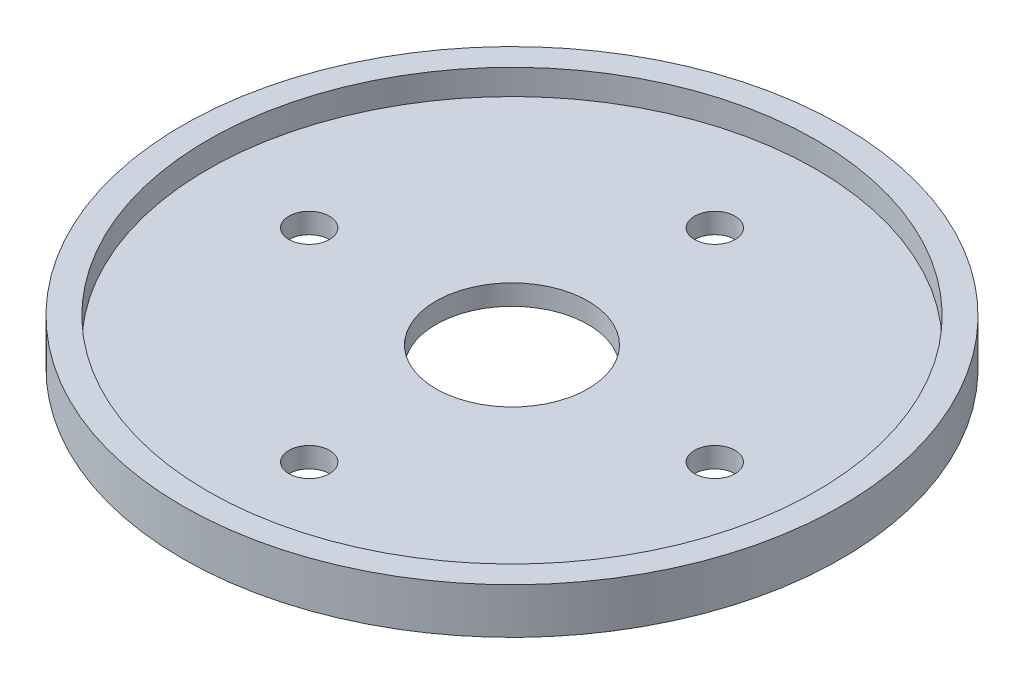
ISO-10303-21;
HEADER;
FILE_DESCRIPTION(('STEP AP214'),'2;1');
FILE_NAME('part.step','',(''),(''),'','','');
FILE_SCHEMA(('AUTOMOTIVE_DESIGN { 1 0 10303 214 1 1 1 1 }'));
ENDSEC;
DATA;
#1=APPLICATION_CONTEXT('core data for automotive mechanical design processes');
#2=APPLICATION_PROTOCOL_DEFINITION('international standard','automotive_design',2000,#1);
#3=PRODUCT_CONTEXT('',#1,'mechanical');
#4=PRODUCT('Part','Part','',(#3));
#5=PRODUCT_RELATED_PRODUCT_CATEGORY('part','',(#4));
#6=PRODUCT_DEFINITION_FORMATION('','',#4);
#7=PRODUCT_DEFINITION_CONTEXT('part definition',#1,'design');
#8=PRODUCT_DEFINITION('design','',#6,#7);
#9=PRODUCT_DEFINITION_SHAPE('','',#8);
#10=(LENGTH_UNIT() NAMED_UNIT(*) SI_UNIT(.MILLI.,.METRE.));
#11=(NAMED_UNIT(*) PLANE_ANGLE_UNIT() SI_UNIT($,.RADIAN.));
#12=(NAMED_UNIT(*) SI_UNIT($,.STERADIAN.) SOLID_ANGLE_UNIT());
#13=UNCERTAINTY_MEASURE_WITH_UNIT(LENGTH_MEASURE(1.E-05),#10,'distance_accuracy_value','');
#14=(GEOMETRIC_REPRESENTATION_CONTEXT(3) GLOBAL_UNCERTAINTY_ASSIGNED_CONTEXT((#13)) GLOBAL_UNIT_ASSIGNED_CONTEXT((#10,
#11,#12)) REPRESENTATION_CONTEXT('',''));
#15=CARTESIAN_POINT('',(0.,0.,0.));
#16=DIRECTION('',(0.,0.,1.));
#17=DIRECTION('',(1.,0.,0.));
#18=AXIS2_PLACEMENT_3D('',#15,#16,#17);
#19=CARTESIAN_POINT('',(0.,2.54,0.));
#20=DIRECTION('',(0.,1.,0.));
#21=DIRECTION('',(0.,0.,1.));
#22=AXIS2_PLACEMENT_3D('',#19,#20,#21);
#23=PLANE('',#22);
#24=CARTESIAN_POINT('',(0.,2.54,0.));
#25=DIRECTION('',(0.,1.,0.));
#26=DIRECTION('',(0.,0.,1.));
#27=AXIS2_PLACEMENT_3D('',#24,#25,#26);
#28=CIRCLE('',#27,9.525);
#29=CARTESIAN_POINT('',(0.,2.54,9.525));
#30=VERTEX_POINT('',#29);
#31=EDGE_CURVE('E40',#30,#30,#28,.T.);
#32=ORIENTED_EDGE('',*,*,#31,.F.);
#33=EDGE_LOOP('',(#32));
#34=FACE_BOUND('',#33,.T.);
#35=CARTESIAN_POINT('',(0.,2.54,-25.4));
#36=DIRECTION('',(0.,1.,0.));
#37=DIRECTION('',(0.,0.,1.));
#38=AXIS2_PLACEMENT_3D('',#35,#36,#37);
#39=CIRCLE('',#38,2.54);
#40=CARTESIAN_POINT('',(0.,2.54,-22.86));
#41=VERTEX_POINT('',#40);
#42=EDGE_CURVE('E44',#41,#41,#39,.T.);
#43=ORIENTED_EDGE('',*,*,#42,.F.);
#44=EDGE_LOOP('',(#43));
#45=FACE_BOUND('',#44,.T.);
#46=CARTESIAN_POINT('',(25.4,2.54,0.));
#47=DIRECTION('',(0.,1.,0.));
#48=DIRECTION('',(0.,0.,1.));
#49=AXIS2_PLACEMENT_3D('',#46,#47,#48);
#50=CIRCLE('',#49,2.54);
#51=CARTESIAN_POINT('',(25.4,2.54,2.54));
#52=VERTEX_POINT('',#51);
#53=EDGE_CURVE('E49',#52,#52,#50,.T.);
#54=ORIENTED_EDGE('',*,*,#53,.F.);
#55=EDGE_LOOP('',(#54));
#56=FACE_BOUND('',#55,.T.);
#57=CARTESIAN_POINT('',(0.,2.54,25.4));
#58=DIRECTION('',(0.,1.,0.));
#59=DIRECTION('',(0.,0.,1.));
#60=AXIS2_PLACEMENT_3D('',#57,#58,#59);
#61=CIRCLE('',#60,2.54);
#62=CARTESIAN_POINT('',(0.,2.54,27.94));
#63=VERTEX_POINT('',#62);
#64=EDGE_CURVE('E74',#63,#63,#61,.T.);
#65=ORIENTED_EDGE('',*,*,#64,.F.);
#66=EDGE_LOOP('',(#65));
#67=FACE_BOUND('',#66,.T.);
#68=CARTESIAN_POINT('',(-25.4,2.54,0.));
#69=DIRECTION('',(0.,1.,0.));
#70=DIRECTION('',(0.,0.,1.));
#71=AXIS2_PLACEMENT_3D('',#68,#69,#70);
#72=CIRCLE('',#71,2.54);
#73=CARTESIAN_POINT('',(-25.4,2.54,2.54));
#74=VERTEX_POINT('',#73);
#75=EDGE_CURVE('E70',#74,#74,#72,.T.);
#76=ORIENTED_EDGE('',*,*,#75,.F.);
#77=EDGE_LOOP('',(#76));
#78=FACE_BOUND('',#77,.T.);
#79=CARTESIAN_POINT('',(0.,2.54,0.));
#80=DIRECTION('',(0.,1.,0.));
#81=DIRECTION('',(0.,0.,1.));
#82=AXIS2_PLACEMENT_3D('',#79,#80,#81);
#83=CIRCLE('',#82,38.1);
#84=CARTESIAN_POINT('',(0.,2.54,38.1));
#85=VERTEX_POINT('',#84);
#86=EDGE_CURVE('E10',#85,#85,#83,.F.);
#87=ORIENTED_EDGE('',*,*,#86,.F.);
#88=EDGE_LOOP('',(#87));
#89=FACE_BOUND('',#88,.T.);
#90=ADVANCED_FACE('F33',(#34,#45,#56,#67,#78,#89),#23,.T.);
#91=CARTESIAN_POINT('',(0.,2.54,0.));
#92=DIRECTION('',(0.,-1.,0.));
#93=DIRECTION('',(0.,0.,-1.));
#94=AXIS2_PLACEMENT_3D('',#91,#92,#93);
#95=CYLINDRICAL_SURFACE('',#94,9.525);
#96=ORIENTED_EDGE('',*,*,#31,.T.);
#97=EDGE_LOOP('',(#96));
#98=FACE_BOUND('',#97,.T.);
#99=CARTESIAN_POINT('',(0.,0.,0.));
#100=DIRECTION('',(0.,1.,0.));
#101=DIRECTION('',(0.,0.,1.));
#102=AXIS2_PLACEMENT_3D('',#99,#100,#101);
#103=CIRCLE('',#102,9.525);
#104=CARTESIAN_POINT('',(0.,0.,9.525));
#105=VERTEX_POINT('',#104);
#106=EDGE_CURVE('E66',#105,#105,#103,.T.);
#107=ORIENTED_EDGE('',*,*,#106,.F.);
#108=EDGE_LOOP('',(#107));
#109=FACE_BOUND('',#108,.T.);
#110=ADVANCED_FACE('F90',(#98,#109),#95,.F.);
#111=CARTESIAN_POINT('',(0.,2.54,-25.4));
#112=DIRECTION('',(0.,-1.,0.));
#113=DIRECTION('',(0.,0.,-1.));
#114=AXIS2_PLACEMENT_3D('',#111,#112,#113);
#115=CYLINDRICAL_SURFACE('',#114,2.54);
#116=ORIENTED_EDGE('',*,*,#42,.T.);
#117=EDGE_LOOP('',(#116));
#118=FACE_BOUND('',#117,.T.);
#119=CARTESIAN_POINT('',(0.,0.,-25.4));
#120=DIRECTION('',(0.,1.,0.));
#121=DIRECTION('',(0.,0.,1.));
#122=AXIS2_PLACEMENT_3D('',#119,#120,#121);
#123=CIRCLE('',#122,2.54);
#124=CARTESIAN_POINT('',(0.,0.,-22.86));
#125=VERTEX_POINT('',#124);
#126=EDGE_CURVE('E63',#125,#125,#123,.T.);
#127=ORIENTED_EDGE('',*,*,#126,.F.);
#128=EDGE_LOOP('',(#127));
#129=FACE_BOUND('',#128,.T.);
#130=ADVANCED_FACE('F117',(#118,#129),#115,.F.);
#131=CARTESIAN_POINT('',(25.4,2.54,0.));
#132=DIRECTION('',(0.,-1.,0.));
#133=DIRECTION('',(0.,0.,-1.));
#134=AXIS2_PLACEMENT_3D('',#131,#132,#133);
#135=CYLINDRICAL_SURFACE('',#134,2.54);
#136=ORIENTED_EDGE('',*,*,#53,.T.);
#137=EDGE_LOOP('',(#136));
#138=FACE_BOUND('',#137,.T.);
#139=CARTESIAN_POINT('',(25.4,0.,0.));
#140=DIRECTION('',(0.,1.,0.));
#141=DIRECTION('',(0.,0.,1.));
#142=AXIS2_PLACEMENT_3D('',#139,#140,#141);
#143=CIRCLE('',#142,2.54);
#144=CARTESIAN_POINT('',(25.4,0.,2.54));
#145=VERTEX_POINT('',#144);
#146=EDGE_CURVE('E60',#145,#145,#143,.T.);
#147=ORIENTED_EDGE('',*,*,#146,.F.);
#148=EDGE_LOOP('',(#147));
#149=FACE_BOUND('',#148,.T.);
#150=ADVANCED_FACE('F85',(#138,#149),#135,.F.);
#151=CARTESIAN_POINT('',(0.,2.54,25.4));
#152=DIRECTION('',(0.,-1.,0.));
#153=DIRECTION('',(0.,0.,-1.));
#154=AXIS2_PLACEMENT_3D('',#151,#152,#153);
#155=CYLINDRICAL_SURFACE('',#154,2.54);
#156=ORIENTED_EDGE('',*,*,#64,.T.);
#157=EDGE_LOOP('',(#156));
#158=FACE_BOUND('',#157,.T.);
#159=CARTESIAN_POINT('',(0.,0.,25.4));
#160=DIRECTION('',(0.,1.,0.));
#161=DIRECTION('',(0.,0.,1.));
#162=AXIS2_PLACEMENT_3D('',#159,#160,#161);
#163=CIRCLE('',#162,2.54);
#164=CARTESIAN_POINT('',(0.,0.,27.94));
#165=VERTEX_POINT('',#164);
#166=EDGE_CURVE('E56',#165,#165,#163,.T.);
#167=ORIENTED_EDGE('',*,*,#166,.F.);
#168=EDGE_LOOP('',(#167));
#169=FACE_BOUND('',#168,.T.);
#170=ADVANCED_FACE('F97',(#158,#169),#155,.F.);
#171=CARTESIAN_POINT('',(-25.4,2.54,0.));
#172=DIRECTION('',(0.,-1.,0.));
#173=DIRECTION('',(0.,0.,-1.));
#174=AXIS2_PLACEMENT_3D('',#171,#172,#173);
#175=CYLINDRICAL_SURFACE('',#174,2.54);
#176=ORIENTED_EDGE('',*,*,#75,.T.);
#177=EDGE_LOOP('',(#176));
#178=FACE_BOUND('',#177,.T.);
#179=CARTESIAN_POINT('',(-25.4,0.,0.));
#180=DIRECTION('',(0.,1.,0.));
#181=DIRECTION('',(0.,0.,1.));
#182=AXIS2_PLACEMENT_3D('',#179,#180,#181);
#183=CIRCLE('',#182,2.54);
#184=CARTESIAN_POINT('',(-25.4,0.,2.54));
#185=VERTEX_POINT('',#184);
#186=EDGE_CURVE('E53',#185,#185,#183,.T.);
#187=ORIENTED_EDGE('',*,*,#186,.F.);
#188=EDGE_LOOP('',(#187));
#189=FACE_BOUND('',#188,.T.);
#190=ADVANCED_FACE('F35',(#178,#189),#175,.F.);
#191=CARTESIAN_POINT('',(0.,2.54,0.));
#192=DIRECTION('',(0.,-1.,0.));
#193=DIRECTION('',(0.,0.,-1.));
#194=AXIS2_PLACEMENT_3D('',#191,#192,#193);
#195=CYLINDRICAL_SURFACE('',#194,41.275);
#196=CARTESIAN_POINT('',(0.,0.,0.));
#197=DIRECTION('',(0.,1.,0.));
#198=DIRECTION('',(0.,0.,1.));
#199=AXIS2_PLACEMENT_3D('',#196,#197,#198);
#200=CIRCLE('',#199,41.275);
#201=CARTESIAN_POINT('',(0.,0.,41.275));
#202=VERTEX_POINT('',#201);
#203=EDGE_CURVE('E68',#202,#202,#200,.T.);
#204=ORIENTED_EDGE('',*,*,#203,.T.);
#205=EDGE_LOOP('',(#204));
#206=FACE_BOUND('',#205,.T.);
#207=CARTESIAN_POINT('',(0.,5.715,0.));
#208=DIRECTION('',(0.,1.,0.));
#209=DIRECTION('',(0.,0.,1.));
#210=AXIS2_PLACEMENT_3D('',#207,#208,#209);
#211=CIRCLE('',#210,41.275);
#212=CARTESIAN_POINT('',(0.,5.715,41.275));
#213=VERTEX_POINT('',#212);
#214=EDGE_CURVE('E57',#213,#213,#211,.T.);
#215=ORIENTED_EDGE('',*,*,#214,.F.);
#216=EDGE_LOOP('',(#215));
#217=FACE_BOUND('',#216,.T.);
#218=ADVANCED_FACE('F106',(#206,#217),#195,.T.);
#219=CARTESIAN_POINT('',(0.,0.,0.));
#220=DIRECTION('',(0.,1.,0.));
#221=DIRECTION('',(0.,0.,1.));
#222=AXIS2_PLACEMENT_3D('',#219,#220,#221);
#223=PLANE('',#222);
#224=ORIENTED_EDGE('',*,*,#186,.T.);
#225=EDGE_LOOP('',(#224));
#226=FACE_BOUND('',#225,.T.);
#227=ORIENTED_EDGE('',*,*,#166,.T.);
#228=EDGE_LOOP('',(#227));
#229=FACE_BOUND('',#228,.T.);
#230=ORIENTED_EDGE('',*,*,#146,.T.);
#231=EDGE_LOOP('',(#230));
#232=FACE_BOUND('',#231,.T.);
#233=ORIENTED_EDGE('',*,*,#126,.T.);
#234=EDGE_LOOP('',(#233));
#235=FACE_BOUND('',#234,.T.);
#236=ORIENTED_EDGE('',*,*,#106,.T.);
#237=EDGE_LOOP('',(#236));
#238=FACE_BOUND('',#237,.T.);
#239=ORIENTED_EDGE('',*,*,#203,.F.);
#240=EDGE_LOOP('',(#239));
#241=FACE_BOUND('',#240,.T.);
#242=ADVANCED_FACE('F102',(#226,#229,#232,#235,#238,#241),#223,.F.);
#243=CARTESIAN_POINT('',(0.,5.715,0.));
#244=DIRECTION('',(0.,1.,0.));
#245=DIRECTION('',(0.,0.,1.));
#246=AXIS2_PLACEMENT_3D('',#243,#244,#245);
#247=PLANE('',#246);
#248=ORIENTED_EDGE('',*,*,#214,.T.);
#249=EDGE_LOOP('',(#248));
#250=FACE_BOUND('',#249,.T.);
#251=CARTESIAN_POINT('',(0.,5.715,0.));
#252=DIRECTION('',(0.,1.,0.));
#253=DIRECTION('',(0.,0.,1.));
#254=AXIS2_PLACEMENT_3D('',#251,#252,#253);
#255=CIRCLE('',#254,38.1);
#256=CARTESIAN_POINT('',(0.,5.715,38.1));
#257=VERTEX_POINT('',#256);
#258=EDGE_CURVE('E205',#257,#257,#255,.T.);
#259=ORIENTED_EDGE('',*,*,#258,.F.);
#260=EDGE_LOOP('',(#259));
#261=FACE_BOUND('',#260,.T.);
#262=ADVANCED_FACE('F105',(#250,#261),#247,.T.);
#263=CARTESIAN_POINT('',(0.,5.715,0.));
#264=DIRECTION('',(0.,-1.,0.));
#265=DIRECTION('',(0.,0.,-1.));
#266=AXIS2_PLACEMENT_3D('',#263,#264,#265);
#267=CYLINDRICAL_SURFACE('',#266,38.1);
#268=ORIENTED_EDGE('',*,*,#258,.T.);
#269=EDGE_LOOP('',(#268));
#270=FACE_BOUND('',#269,.T.);
#271=ORIENTED_EDGE('',*,*,#86,.T.);
#272=EDGE_LOOP('',(#271));
#273=FACE_BOUND('',#272,.T.);
#274=ADVANCED_FACE('F156',(#270,#273),#267,.F.);
#275=CLOSED_SHELL('',(#90,#110,#130,#150,#170,#190,#218,#242,#262,#274));
#276=MANIFOLD_SOLID_BREP('B2',#275);
#277=ADVANCED_BREP_SHAPE_REPRESENTATION('',(#18,#276),#14);
#278=SHAPE_DEFINITION_REPRESENTATION(#9,#277);
ENDSEC;
END-ISO-10303-21;
